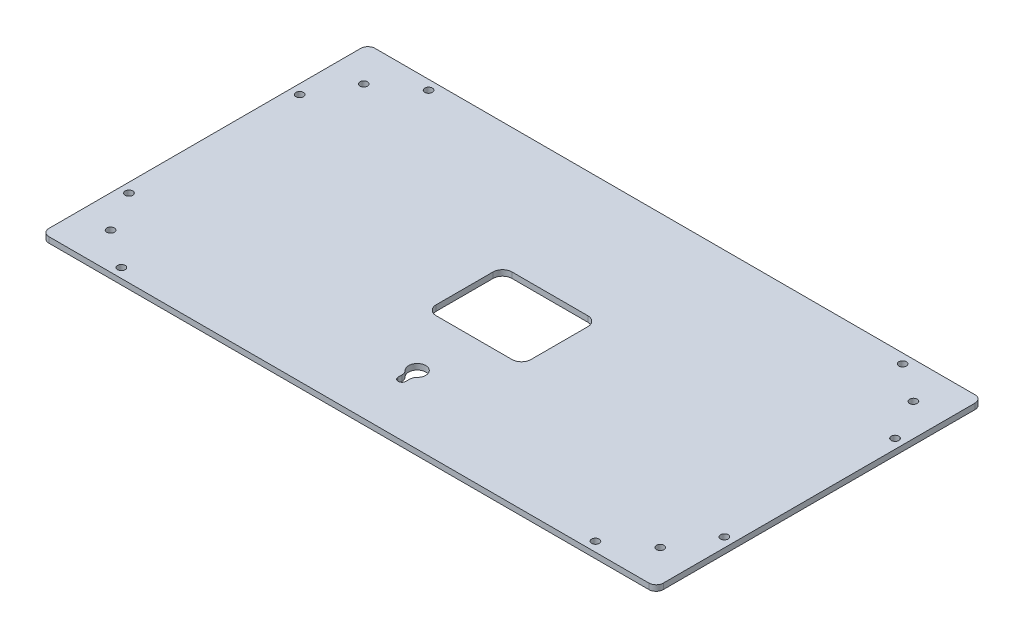
ISO-10303-21;
HEADER;
FILE_DESCRIPTION(('STEP AP214'),'2;1');
FILE_NAME('part.step','',(''),(''),'','','');
FILE_SCHEMA(('AUTOMOTIVE_DESIGN { 1 0 10303 214 1 1 1 1 }'));
ENDSEC;
DATA;
#1=APPLICATION_CONTEXT('core data for automotive mechanical design processes');
#2=APPLICATION_PROTOCOL_DEFINITION('international standard','automotive_design',2000,#1);
#3=PRODUCT_CONTEXT('',#1,'mechanical');
#4=PRODUCT('Part','Part','',(#3));
#5=PRODUCT_RELATED_PRODUCT_CATEGORY('part','',(#4));
#6=PRODUCT_DEFINITION_FORMATION('','',#4);
#7=PRODUCT_DEFINITION_CONTEXT('part definition',#1,'design');
#8=PRODUCT_DEFINITION('design','',#6,#7);
#9=PRODUCT_DEFINITION_SHAPE('','',#8);
#10=(LENGTH_UNIT() NAMED_UNIT(*) SI_UNIT(.MILLI.,.METRE.));
#11=(NAMED_UNIT(*) PLANE_ANGLE_UNIT() SI_UNIT($,.RADIAN.));
#12=(NAMED_UNIT(*) SI_UNIT($,.STERADIAN.) SOLID_ANGLE_UNIT());
#13=UNCERTAINTY_MEASURE_WITH_UNIT(LENGTH_MEASURE(1.E-05),#10,'distance_accuracy_value','');
#14=(GEOMETRIC_REPRESENTATION_CONTEXT(3) GLOBAL_UNCERTAINTY_ASSIGNED_CONTEXT((#13)) GLOBAL_UNIT_ASSIGNED_CONTEXT((#10,
#11,#12)) REPRESENTATION_CONTEXT('',''));
#15=CARTESIAN_POINT('',(0.,0.,0.));
#16=DIRECTION('',(0.,0.,1.));
#17=DIRECTION('',(1.,0.,0.));
#18=AXIS2_PLACEMENT_3D('',#15,#16,#17);
#19=CARTESIAN_POINT('',(158.2,0.,-82.2));
#20=DIRECTION('',(0.,-1.,0.));
#21=DIRECTION('',(0.,0.,-1.));
#22=AXIS2_PLACEMENT_3D('',#19,#20,#21);
#23=CYLINDRICAL_SURFACE('',#22,3.8);
#24=CARTESIAN_POINT('',(158.2,-3.,-82.2));
#25=DIRECTION('',(0.,-1.,0.));
#26=DIRECTION('',(0.,0.,-1.));
#27=AXIS2_PLACEMENT_3D('',#24,#25,#26);
#28=CIRCLE('',#27,3.8);
#29=CARTESIAN_POINT('',(158.2,-3.,-86.));
#30=VERTEX_POINT('',#29);
#31=CARTESIAN_POINT('',(162.,-3.,-82.2));
#32=VERTEX_POINT('',#31);
#33=EDGE_CURVE('E369',#30,#32,#28,.T.);
#34=ORIENTED_EDGE('',*,*,#33,.F.);
#35=DIRECTION('',(0.,-1.,0.));
#36=VECTOR('',#35,1.);
#37=CARTESIAN_POINT('',(158.2,0.,-86.));
#38=LINE('',#37,#36);
#39=CARTESIAN_POINT('',(158.2,0.,-86.));
#40=VERTEX_POINT('',#39);
#41=EDGE_CURVE('E11',#40,#30,#38,.T.);
#42=ORIENTED_EDGE('',*,*,#41,.F.);
#43=CARTESIAN_POINT('',(158.2,0.,-82.2));
#44=DIRECTION('',(0.,-1.,0.));
#45=DIRECTION('',(0.,0.,-1.));
#46=AXIS2_PLACEMENT_3D('',#43,#44,#45);
#47=CIRCLE('',#46,3.8);
#48=CARTESIAN_POINT('',(162.,0.,-82.2));
#49=VERTEX_POINT('',#48);
#50=EDGE_CURVE('E372',#40,#49,#47,.T.);
#51=ORIENTED_EDGE('',*,*,#50,.T.);
#52=DIRECTION('',(0.,-1.,0.));
#53=VECTOR('',#52,1.);
#54=CARTESIAN_POINT('',(162.,0.,-82.2));
#55=LINE('',#54,#53);
#56=EDGE_CURVE('E37',#49,#32,#55,.T.);
#57=ORIENTED_EDGE('',*,*,#56,.T.);
#58=EDGE_LOOP('',(#34,#42,#51,#57));
#59=FACE_BOUND('',#58,.T.);
#60=ADVANCED_FACE('F34',(#59),#23,.T.);
#61=CARTESIAN_POINT('',(-158.2,0.,-86.));
#62=DIRECTION('',(0.,0.,-1.));
#63=DIRECTION('',(-1.,0.,0.));
#64=AXIS2_PLACEMENT_3D('',#61,#62,#63);
#65=PLANE('',#64);
#66=DIRECTION('',(1.,0.,0.));
#67=VECTOR('',#66,1.);
#68=CARTESIAN_POINT('',(-158.2,-3.,-86.));
#69=LINE('',#68,#67);
#70=CARTESIAN_POINT('',(-158.2,-3.,-86.));
#71=VERTEX_POINT('',#70);
#72=EDGE_CURVE('E376',#71,#30,#69,.T.);
#73=ORIENTED_EDGE('',*,*,#72,.F.);
#74=DIRECTION('',(0.,-1.,0.));
#75=VECTOR('',#74,1.);
#76=CARTESIAN_POINT('',(-158.2,0.,-86.));
#77=LINE('',#76,#75);
#78=CARTESIAN_POINT('',(-158.2,0.,-86.));
#79=VERTEX_POINT('',#78);
#80=EDGE_CURVE('E42',#79,#71,#77,.T.);
#81=ORIENTED_EDGE('',*,*,#80,.F.);
#82=DIRECTION('',(1.,0.,0.));
#83=VECTOR('',#82,1.);
#84=CARTESIAN_POINT('',(-158.2,0.,-86.));
#85=LINE('',#84,#83);
#86=EDGE_CURVE('E394',#79,#40,#85,.T.);
#87=ORIENTED_EDGE('',*,*,#86,.T.);
#88=ORIENTED_EDGE('',*,*,#41,.T.);
#89=EDGE_LOOP('',(#73,#81,#87,#88));
#90=FACE_BOUND('',#89,.T.);
#91=ADVANCED_FACE('F441',(#90),#65,.T.);
#92=CARTESIAN_POINT('',(-158.2,0.,-82.2));
#93=DIRECTION('',(0.,-1.,0.));
#94=DIRECTION('',(0.,0.,-1.));
#95=AXIS2_PLACEMENT_3D('',#92,#93,#94);
#96=CYLINDRICAL_SURFACE('',#95,3.8);
#97=CARTESIAN_POINT('',(-158.2,-3.,-82.2));
#98=DIRECTION('',(0.,-1.,0.));
#99=DIRECTION('',(0.,0.,-1.));
#100=AXIS2_PLACEMENT_3D('',#97,#98,#99);
#101=CIRCLE('',#100,3.8);
#102=CARTESIAN_POINT('',(-162.,-3.,-82.2));
#103=VERTEX_POINT('',#102);
#104=EDGE_CURVE('E414',#103,#71,#101,.T.);
#105=ORIENTED_EDGE('',*,*,#104,.F.);
#106=DIRECTION('',(0.,-1.,0.));
#107=VECTOR('',#106,1.);
#108=CARTESIAN_POINT('',(-162.,0.,-82.2));
#109=LINE('',#108,#107);
#110=CARTESIAN_POINT('',(-162.,0.,-82.2));
#111=VERTEX_POINT('',#110);
#112=EDGE_CURVE('E420',#111,#103,#109,.T.);
#113=ORIENTED_EDGE('',*,*,#112,.F.);
#114=CARTESIAN_POINT('',(-158.2,0.,-82.2));
#115=DIRECTION('',(0.,-1.,0.));
#116=DIRECTION('',(0.,0.,-1.));
#117=AXIS2_PLACEMENT_3D('',#114,#115,#116);
#118=CIRCLE('',#117,3.8);
#119=EDGE_CURVE('E391',#111,#79,#118,.T.);
#120=ORIENTED_EDGE('',*,*,#119,.T.);
#121=ORIENTED_EDGE('',*,*,#80,.T.);
#122=EDGE_LOOP('',(#105,#113,#120,#121));
#123=FACE_BOUND('',#122,.T.);
#124=ADVANCED_FACE('F461',(#123),#96,.T.);
#125=CARTESIAN_POINT('',(-162.,0.,82.2));
#126=DIRECTION('',(-1.,0.,0.));
#127=DIRECTION('',(0.,0.,1.));
#128=AXIS2_PLACEMENT_3D('',#125,#126,#127);
#129=PLANE('',#128);
#130=DIRECTION('',(0.,0.,-1.));
#131=VECTOR('',#130,1.);
#132=CARTESIAN_POINT('',(-162.,-3.,82.2));
#133=LINE('',#132,#131);
#134=CARTESIAN_POINT('',(-162.,-3.,82.2));
#135=VERTEX_POINT('',#134);
#136=EDGE_CURVE('E411',#135,#103,#133,.T.);
#137=ORIENTED_EDGE('',*,*,#136,.F.);
#138=DIRECTION('',(0.,-1.,0.));
#139=VECTOR('',#138,1.);
#140=CARTESIAN_POINT('',(-162.,0.,82.2));
#141=LINE('',#140,#139);
#142=CARTESIAN_POINT('',(-162.,0.,82.2));
#143=VERTEX_POINT('',#142);
#144=EDGE_CURVE('E422',#143,#135,#141,.T.);
#145=ORIENTED_EDGE('',*,*,#144,.F.);
#146=DIRECTION('',(0.,0.,-1.));
#147=VECTOR('',#146,1.);
#148=CARTESIAN_POINT('',(-162.,0.,82.2));
#149=LINE('',#148,#147);
#150=EDGE_CURVE('E388',#143,#111,#149,.T.);
#151=ORIENTED_EDGE('',*,*,#150,.T.);
#152=ORIENTED_EDGE('',*,*,#112,.T.);
#153=EDGE_LOOP('',(#137,#145,#151,#152));
#154=FACE_BOUND('',#153,.T.);
#155=ADVANCED_FACE('F459',(#154),#129,.T.);
#156=CARTESIAN_POINT('',(-158.2,0.,82.2));
#157=DIRECTION('',(0.,-1.,0.));
#158=DIRECTION('',(0.,0.,-1.));
#159=AXIS2_PLACEMENT_3D('',#156,#157,#158);
#160=CYLINDRICAL_SURFACE('',#159,3.8);
#161=CARTESIAN_POINT('',(-158.2,-3.,82.2));
#162=DIRECTION('',(0.,-1.,0.));
#163=DIRECTION('',(0.,0.,-1.));
#164=AXIS2_PLACEMENT_3D('',#161,#162,#163);
#165=CIRCLE('',#164,3.8);
#166=CARTESIAN_POINT('',(-158.2,-3.,86.));
#167=VERTEX_POINT('',#166);
#168=EDGE_CURVE('E408',#167,#135,#165,.T.);
#169=ORIENTED_EDGE('',*,*,#168,.F.);
#170=DIRECTION('',(0.,-1.,0.));
#171=VECTOR('',#170,1.);
#172=CARTESIAN_POINT('',(-158.2,0.,86.));
#173=LINE('',#172,#171);
#174=CARTESIAN_POINT('',(-158.2,0.,86.));
#175=VERTEX_POINT('',#174);
#176=EDGE_CURVE('E424',#175,#167,#173,.T.);
#177=ORIENTED_EDGE('',*,*,#176,.F.);
#178=CARTESIAN_POINT('',(-158.2,0.,82.2));
#179=DIRECTION('',(0.,-1.,0.));
#180=DIRECTION('',(0.,0.,-1.));
#181=AXIS2_PLACEMENT_3D('',#178,#179,#180);
#182=CIRCLE('',#181,3.8);
#183=EDGE_CURVE('E385',#175,#143,#182,.T.);
#184=ORIENTED_EDGE('',*,*,#183,.T.);
#185=ORIENTED_EDGE('',*,*,#144,.T.);
#186=EDGE_LOOP('',(#169,#177,#184,#185));
#187=FACE_BOUND('',#186,.T.);
#188=ADVANCED_FACE('F455',(#187),#160,.T.);
#189=CARTESIAN_POINT('',(158.2,0.,86.));
#190=DIRECTION('',(0.,0.,1.));
#191=DIRECTION('',(1.,0.,0.));
#192=AXIS2_PLACEMENT_3D('',#189,#190,#191);
#193=PLANE('',#192);
#194=DIRECTION('',(-1.,0.,0.));
#195=VECTOR('',#194,1.);
#196=CARTESIAN_POINT('',(158.2,-3.,86.));
#197=LINE('',#196,#195);
#198=CARTESIAN_POINT('',(158.2,-3.,86.));
#199=VERTEX_POINT('',#198);
#200=EDGE_CURVE('E405',#199,#167,#197,.T.);
#201=ORIENTED_EDGE('',*,*,#200,.F.);
#202=DIRECTION('',(0.,-1.,0.));
#203=VECTOR('',#202,1.);
#204=CARTESIAN_POINT('',(158.2,0.,86.));
#205=LINE('',#204,#203);
#206=CARTESIAN_POINT('',(158.2,0.,86.));
#207=VERTEX_POINT('',#206);
#208=EDGE_CURVE('E426',#207,#199,#205,.T.);
#209=ORIENTED_EDGE('',*,*,#208,.F.);
#210=DIRECTION('',(-1.,0.,0.));
#211=VECTOR('',#210,1.);
#212=CARTESIAN_POINT('',(158.2,0.,86.));
#213=LINE('',#212,#211);
#214=EDGE_CURVE('E382',#207,#175,#213,.T.);
#215=ORIENTED_EDGE('',*,*,#214,.T.);
#216=ORIENTED_EDGE('',*,*,#176,.T.);
#217=EDGE_LOOP('',(#201,#209,#215,#216));
#218=FACE_BOUND('',#217,.T.);
#219=ADVANCED_FACE('F453',(#218),#193,.T.);
#220=CARTESIAN_POINT('',(158.2,0.,82.2));
#221=DIRECTION('',(0.,-1.,0.));
#222=DIRECTION('',(0.,0.,-1.));
#223=AXIS2_PLACEMENT_3D('',#220,#221,#222);
#224=CYLINDRICAL_SURFACE('',#223,3.8);
#225=CARTESIAN_POINT('',(158.2,-3.,82.2));
#226=DIRECTION('',(0.,-1.,0.));
#227=DIRECTION('',(0.,0.,-1.));
#228=AXIS2_PLACEMENT_3D('',#225,#226,#227);
#229=CIRCLE('',#228,3.8);
#230=CARTESIAN_POINT('',(162.,-3.,82.2));
#231=VERTEX_POINT('',#230);
#232=EDGE_CURVE('E402',#231,#199,#229,.T.);
#233=ORIENTED_EDGE('',*,*,#232,.F.);
#234=DIRECTION('',(0.,-1.,0.));
#235=VECTOR('',#234,1.);
#236=CARTESIAN_POINT('',(162.,0.,82.2));
#237=LINE('',#236,#235);
#238=CARTESIAN_POINT('',(162.,0.,82.2));
#239=VERTEX_POINT('',#238);
#240=EDGE_CURVE('E427',#239,#231,#237,.T.);
#241=ORIENTED_EDGE('',*,*,#240,.F.);
#242=CARTESIAN_POINT('',(158.2,0.,82.2));
#243=DIRECTION('',(0.,-1.,0.));
#244=DIRECTION('',(0.,0.,-1.));
#245=AXIS2_PLACEMENT_3D('',#242,#243,#244);
#246=CIRCLE('',#245,3.8);
#247=EDGE_CURVE('E379',#239,#207,#246,.T.);
#248=ORIENTED_EDGE('',*,*,#247,.T.);
#249=ORIENTED_EDGE('',*,*,#208,.T.);
#250=EDGE_LOOP('',(#233,#241,#248,#249));
#251=FACE_BOUND('',#250,.T.);
#252=ADVANCED_FACE('F449',(#251),#224,.T.);
#253=CARTESIAN_POINT('',(162.,0.,-82.2));
#254=DIRECTION('',(1.,0.,0.));
#255=DIRECTION('',(0.,0.,-1.));
#256=AXIS2_PLACEMENT_3D('',#253,#254,#255);
#257=PLANE('',#256);
#258=DIRECTION('',(0.,0.,1.));
#259=VECTOR('',#258,1.);
#260=CARTESIAN_POINT('',(162.,-3.,-82.2));
#261=LINE('',#260,#259);
#262=EDGE_CURVE('E399',#32,#231,#261,.T.);
#263=ORIENTED_EDGE('',*,*,#262,.F.);
#264=ORIENTED_EDGE('',*,*,#56,.F.);
#265=DIRECTION('',(0.,0.,1.));
#266=VECTOR('',#265,1.);
#267=CARTESIAN_POINT('',(162.,0.,-82.2));
#268=LINE('',#267,#266);
#269=EDGE_CURVE('E375',#49,#239,#268,.T.);
#270=ORIENTED_EDGE('',*,*,#269,.T.);
#271=ORIENTED_EDGE('',*,*,#240,.T.);
#272=EDGE_LOOP('',(#263,#264,#270,#271));
#273=FACE_BOUND('',#272,.T.);
#274=ADVANCED_FACE('F435',(#273),#257,.T.);
#275=CARTESIAN_POINT('',(158.2,0.,-82.2));
#276=DIRECTION('',(0.,-1.,0.));
#277=DIRECTION('',(0.,0.,-1.));
#278=AXIS2_PLACEMENT_3D('',#275,#276,#277);
#279=PLANE('',#278);
#280=DIRECTION('',(0.,0.,1.));
#281=VECTOR('',#280,1.);
#282=CARTESIAN_POINT('',(25.,0.,15.));
#283=LINE('',#282,#281);
#284=CARTESIAN_POINT('',(25.,0.,-15.));
#285=VERTEX_POINT('',#284);
#286=CARTESIAN_POINT('',(25.,0.,15.));
#287=VERTEX_POINT('',#286);
#288=EDGE_CURVE('E191',#285,#287,#283,.T.);
#289=ORIENTED_EDGE('',*,*,#288,.T.);
#290=CARTESIAN_POINT('',(20.,0.,15.));
#291=DIRECTION('',(0.,-1.,0.));
#292=DIRECTION('',(0.,0.,1.));
#293=AXIS2_PLACEMENT_3D('',#290,#291,#292);
#294=CIRCLE('',#293,5.);
#295=CARTESIAN_POINT('',(20.,0.,20.));
#296=VERTEX_POINT('',#295);
#297=EDGE_CURVE('E185',#287,#296,#294,.T.);
#298=ORIENTED_EDGE('',*,*,#297,.T.);
#299=DIRECTION('',(-1.,0.,0.));
#300=VECTOR('',#299,1.);
#301=CARTESIAN_POINT('',(-20.,0.,20.));
#302=LINE('',#301,#300);
#303=CARTESIAN_POINT('',(-20.,0.,20.));
#304=VERTEX_POINT('',#303);
#305=EDGE_CURVE('E194',#296,#304,#302,.T.);
#306=ORIENTED_EDGE('',*,*,#305,.T.);
#307=CARTESIAN_POINT('',(-20.,0.,15.));
#308=DIRECTION('',(0.,-1.,0.));
#309=DIRECTION('',(0.,0.,1.));
#310=AXIS2_PLACEMENT_3D('',#307,#308,#309);
#311=CIRCLE('',#310,5.);
#312=CARTESIAN_POINT('',(-25.,0.,15.));
#313=VERTEX_POINT('',#312);
#314=EDGE_CURVE('E50',#304,#313,#311,.T.);
#315=ORIENTED_EDGE('',*,*,#314,.T.);
#316=DIRECTION('',(0.,0.,-1.));
#317=VECTOR('',#316,1.);
#318=CARTESIAN_POINT('',(-25.,0.,-15.));
#319=LINE('',#318,#317);
#320=CARTESIAN_POINT('',(-25.,0.,-15.));
#321=VERTEX_POINT('',#320);
#322=EDGE_CURVE('E209',#313,#321,#319,.T.);
#323=ORIENTED_EDGE('',*,*,#322,.T.);
#324=CARTESIAN_POINT('',(-20.,0.,-15.));
#325=DIRECTION('',(0.,-1.,0.));
#326=DIRECTION('',(0.,0.,1.));
#327=AXIS2_PLACEMENT_3D('',#324,#325,#326);
#328=CIRCLE('',#327,5.);
#329=CARTESIAN_POINT('',(-20.,0.,-20.));
#330=VERTEX_POINT('',#329);
#331=EDGE_CURVE('E212',#321,#330,#328,.T.);
#332=ORIENTED_EDGE('',*,*,#331,.T.);
#333=DIRECTION('',(1.,0.,0.));
#334=VECTOR('',#333,1.);
#335=CARTESIAN_POINT('',(20.,0.,-20.));
#336=LINE('',#335,#334);
#337=CARTESIAN_POINT('',(20.,0.,-20.));
#338=VERTEX_POINT('',#337);
#339=EDGE_CURVE('E215',#330,#338,#336,.T.);
#340=ORIENTED_EDGE('',*,*,#339,.T.);
#341=CARTESIAN_POINT('',(20.,0.,-15.));
#342=DIRECTION('',(0.,-1.,0.));
#343=DIRECTION('',(0.,0.,1.));
#344=AXIS2_PLACEMENT_3D('',#341,#342,#343);
#345=CIRCLE('',#344,5.);
#346=EDGE_CURVE('E218',#338,#285,#345,.T.);
#347=ORIENTED_EDGE('',*,*,#346,.T.);
#348=EDGE_LOOP('',(#289,#298,#306,#315,#323,#332,#340,#347));
#349=FACE_BOUND('',#348,.T.);
#350=CARTESIAN_POINT('',(-125.,0.,81.));
#351=DIRECTION('',(0.,-1.,0.));
#352=DIRECTION('',(0.,0.,1.));
#353=AXIS2_PLACEMENT_3D('',#350,#351,#352);
#354=CIRCLE('',#353,2.);
#355=CARTESIAN_POINT('',(-125.,0.,83.));
#356=VERTEX_POINT('',#355);
#357=EDGE_CURVE('E252',#356,#356,#354,.T.);
#358=ORIENTED_EDGE('',*,*,#357,.T.);
#359=EDGE_LOOP('',(#358));
#360=FACE_BOUND('',#359,.T.);
#361=CARTESIAN_POINT('',(125.,0.,81.));
#362=DIRECTION('',(0.,-1.,0.));
#363=DIRECTION('',(0.,0.,1.));
#364=AXIS2_PLACEMENT_3D('',#361,#362,#363);
#365=CIRCLE('',#364,2.);
#366=CARTESIAN_POINT('',(125.,0.,83.));
#367=VERTEX_POINT('',#366);
#368=EDGE_CURVE('E258',#367,#367,#365,.T.);
#369=ORIENTED_EDGE('',*,*,#368,.T.);
#370=EDGE_LOOP('',(#369));
#371=FACE_BOUND('',#370,.T.);
#372=CARTESIAN_POINT('',(-157.,0.,45.));
#373=DIRECTION('',(0.,-1.,0.));
#374=DIRECTION('',(0.,0.,1.));
#375=AXIS2_PLACEMENT_3D('',#372,#373,#374);
#376=CIRCLE('',#375,2.);
#377=CARTESIAN_POINT('',(-157.,0.,47.));
#378=VERTEX_POINT('',#377);
#379=EDGE_CURVE('E264',#378,#378,#376,.T.);
#380=ORIENTED_EDGE('',*,*,#379,.T.);
#381=EDGE_LOOP('',(#380));
#382=FACE_BOUND('',#381,.T.);
#383=CARTESIAN_POINT('',(-157.,0.,-45.));
#384=DIRECTION('',(0.,-1.,0.));
#385=DIRECTION('',(0.,0.,1.));
#386=AXIS2_PLACEMENT_3D('',#383,#384,#385);
#387=CIRCLE('',#386,2.);
#388=CARTESIAN_POINT('',(-157.,0.,-43.));
#389=VERTEX_POINT('',#388);
#390=EDGE_CURVE('E270',#389,#389,#387,.T.);
#391=ORIENTED_EDGE('',*,*,#390,.T.);
#392=EDGE_LOOP('',(#391));
#393=FACE_BOUND('',#392,.T.);
#394=CARTESIAN_POINT('',(-125.,0.,-81.));
#395=DIRECTION('',(0.,-1.,0.));
#396=DIRECTION('',(0.,0.,1.));
#397=AXIS2_PLACEMENT_3D('',#394,#395,#396);
#398=CIRCLE('',#397,2.);
#399=CARTESIAN_POINT('',(-125.,0.,-79.));
#400=VERTEX_POINT('',#399);
#401=EDGE_CURVE('E276',#400,#400,#398,.T.);
#402=ORIENTED_EDGE('',*,*,#401,.T.);
#403=EDGE_LOOP('',(#402));
#404=FACE_BOUND('',#403,.T.);
#405=CARTESIAN_POINT('',(125.,0.,-81.));
#406=DIRECTION('',(0.,-1.,0.));
#407=DIRECTION('',(0.,0.,1.));
#408=AXIS2_PLACEMENT_3D('',#405,#406,#407);
#409=CIRCLE('',#408,2.);
#410=CARTESIAN_POINT('',(125.,0.,-79.));
#411=VERTEX_POINT('',#410);
#412=EDGE_CURVE('E282',#411,#411,#409,.T.);
#413=ORIENTED_EDGE('',*,*,#412,.T.);
#414=EDGE_LOOP('',(#413));
#415=FACE_BOUND('',#414,.T.);
#416=CARTESIAN_POINT('',(157.,0.,-45.));
#417=DIRECTION('',(0.,-1.,0.));
#418=DIRECTION('',(0.,0.,1.));
#419=AXIS2_PLACEMENT_3D('',#416,#417,#418);
#420=CIRCLE('',#419,2.);
#421=CARTESIAN_POINT('',(157.,0.,-43.));
#422=VERTEX_POINT('',#421);
#423=EDGE_CURVE('E288',#422,#422,#420,.T.);
#424=ORIENTED_EDGE('',*,*,#423,.T.);
#425=EDGE_LOOP('',(#424));
#426=FACE_BOUND('',#425,.T.);
#427=CARTESIAN_POINT('',(157.,0.,45.));
#428=DIRECTION('',(0.,-1.,0.));
#429=DIRECTION('',(0.,0.,1.));
#430=AXIS2_PLACEMENT_3D('',#427,#428,#429);
#431=CIRCLE('',#430,2.);
#432=CARTESIAN_POINT('',(157.,0.,47.));
#433=VERTEX_POINT('',#432);
#434=EDGE_CURVE('E294',#433,#433,#431,.T.);
#435=ORIENTED_EDGE('',*,*,#434,.T.);
#436=EDGE_LOOP('',(#435));
#437=FACE_BOUND('',#436,.T.);
#438=DIRECTION('',(0.,0.,1.));
#439=VECTOR('',#438,1.);
#440=CARTESIAN_POINT('',(2.,0.,58.));
#441=LINE('',#440,#439);
#442=CARTESIAN_POINT('',(1.99999999999998,0.,56.));
#443=VERTEX_POINT('',#442);
#444=CARTESIAN_POINT('',(2.,0.,58.));
#445=VERTEX_POINT('',#444);
#446=EDGE_CURVE('E316',#443,#445,#441,.T.);
#447=ORIENTED_EDGE('',*,*,#446,.T.);
#448=CARTESIAN_POINT('',(0.,0.,58.));
#449=DIRECTION('',(0.,-1.,0.));
#450=DIRECTION('',(0.,0.,1.));
#451=AXIS2_PLACEMENT_3D('',#448,#449,#450);
#452=CIRCLE('',#451,2.);
#453=CARTESIAN_POINT('',(-2.,0.,58.));
#454=VERTEX_POINT('',#453);
#455=EDGE_CURVE('E300',#445,#454,#452,.T.);
#456=ORIENTED_EDGE('',*,*,#455,.T.);
#457=DIRECTION('',(0.,0.,-1.));
#458=VECTOR('',#457,1.);
#459=CARTESIAN_POINT('',(-2.,0.,56.));
#460=LINE('',#459,#458);
#461=CARTESIAN_POINT('',(-2.,0.,56.));
#462=VERTEX_POINT('',#461);
#463=EDGE_CURVE('E303',#454,#462,#460,.T.);
#464=ORIENTED_EDGE('',*,*,#463,.T.);
#465=CARTESIAN_POINT('',(-6.,0.,56.));
#466=DIRECTION('',(0.,1.,0.));
#467=DIRECTION('',(0.,0.,-1.));
#468=AXIS2_PLACEMENT_3D('',#465,#466,#467);
#469=CIRCLE('',#468,4.00000000000002);
#470=CARTESIAN_POINT('',(-3.17647058823531,0.,53.1666836285194));
#471=VERTEX_POINT('',#470);
#472=EDGE_CURVE('E307',#462,#471,#469,.T.);
#473=ORIENTED_EDGE('',*,*,#472,.T.);
#474=CARTESIAN_POINT('',(0.,0.,49.9792027106038));
#475=DIRECTION('',(0.,-1.,0.));
#476=DIRECTION('',(0.,0.,1.));
#477=AXIS2_PLACEMENT_3D('',#474,#475,#476);
#478=CIRCLE('',#477,4.5);
#479=CARTESIAN_POINT('',(3.1764705882353,0.,53.1666836285194));
#480=VERTEX_POINT('',#479);
#481=EDGE_CURVE('E310',#471,#480,#478,.T.);
#482=ORIENTED_EDGE('',*,*,#481,.T.);
#483=CARTESIAN_POINT('',(6.,0.,56.));
#484=DIRECTION('',(0.,1.,0.));
#485=DIRECTION('',(0.,0.,-1.));
#486=AXIS2_PLACEMENT_3D('',#483,#484,#485);
#487=CIRCLE('',#486,4.00000000000002);
#488=EDGE_CURVE('E313',#480,#443,#487,.T.);
#489=ORIENTED_EDGE('',*,*,#488,.T.);
#490=EDGE_LOOP('',(#447,#456,#464,#473,#482,#489));
#491=FACE_BOUND('',#490,.T.);
#492=CARTESIAN_POINT('',(144.95,0.,66.75));
#493=DIRECTION('',(0.,-1.,0.));
#494=DIRECTION('',(0.,0.,1.));
#495=AXIS2_PLACEMENT_3D('',#492,#493,#494);
#496=CIRCLE('',#495,2.);
#497=CARTESIAN_POINT('',(144.95,0.,68.75));
#498=VERTEX_POINT('',#497);
#499=EDGE_CURVE('E348',#498,#498,#496,.T.);
#500=ORIENTED_EDGE('',*,*,#499,.T.);
#501=EDGE_LOOP('',(#500));
#502=FACE_BOUND('',#501,.T.);
#503=CARTESIAN_POINT('',(144.95,0.,-66.75));
#504=DIRECTION('',(0.,-1.,0.));
#505=DIRECTION('',(0.,0.,1.));
#506=AXIS2_PLACEMENT_3D('',#503,#504,#505);
#507=CIRCLE('',#506,2.);
#508=CARTESIAN_POINT('',(144.95,0.,-64.75));
#509=VERTEX_POINT('',#508);
#510=EDGE_CURVE('E354',#509,#509,#507,.T.);
#511=ORIENTED_EDGE('',*,*,#510,.T.);
#512=EDGE_LOOP('',(#511));
#513=FACE_BOUND('',#512,.T.);
#514=CARTESIAN_POINT('',(-144.95,0.,-66.75));
#515=DIRECTION('',(0.,-1.,0.));
#516=DIRECTION('',(0.,0.,1.));
#517=AXIS2_PLACEMENT_3D('',#514,#515,#516);
#518=CIRCLE('',#517,2.);
#519=CARTESIAN_POINT('',(-144.95,0.,-64.75));
#520=VERTEX_POINT('',#519);
#521=EDGE_CURVE('E360',#520,#520,#518,.T.);
#522=ORIENTED_EDGE('',*,*,#521,.T.);
#523=EDGE_LOOP('',(#522));
#524=FACE_BOUND('',#523,.T.);
#525=CARTESIAN_POINT('',(-144.95,0.,66.75));
#526=DIRECTION('',(0.,-1.,0.));
#527=DIRECTION('',(0.,0.,1.));
#528=AXIS2_PLACEMENT_3D('',#525,#526,#527);
#529=CIRCLE('',#528,2.);
#530=CARTESIAN_POINT('',(-144.95,0.,68.75));
#531=VERTEX_POINT('',#530);
#532=EDGE_CURVE('E366',#531,#531,#529,.T.);
#533=ORIENTED_EDGE('',*,*,#532,.T.);
#534=EDGE_LOOP('',(#533));
#535=FACE_BOUND('',#534,.T.);
#536=ORIENTED_EDGE('',*,*,#50,.F.);
#537=ORIENTED_EDGE('',*,*,#86,.F.);
#538=ORIENTED_EDGE('',*,*,#119,.F.);
#539=ORIENTED_EDGE('',*,*,#150,.F.);
#540=ORIENTED_EDGE('',*,*,#183,.F.);
#541=ORIENTED_EDGE('',*,*,#214,.F.);
#542=ORIENTED_EDGE('',*,*,#247,.F.);
#543=ORIENTED_EDGE('',*,*,#269,.F.);
#544=EDGE_LOOP('',(#536,#537,#538,#539,#540,#541,#542,#543));
#545=FACE_BOUND('',#544,.T.);
#546=ADVANCED_FACE('F198',(#349,#360,#371,#382,#393,#404,#415,#426,#437,#491,#502,#513,#524,
#535,#545),#279,.F.);
#547=CARTESIAN_POINT('',(158.2,-3.,-82.2));
#548=DIRECTION('',(0.,-1.,0.));
#549=DIRECTION('',(0.,0.,-1.));
#550=AXIS2_PLACEMENT_3D('',#547,#548,#549);
#551=PLANE('',#550);
#552=CARTESIAN_POINT('',(20.,-3.,15.));
#553=DIRECTION('',(0.,-1.,0.));
#554=DIRECTION('',(0.,0.,1.));
#555=AXIS2_PLACEMENT_3D('',#552,#553,#554);
#556=CIRCLE('',#555,5.);
#557=CARTESIAN_POINT('',(25.,-3.,15.));
#558=VERTEX_POINT('',#557);
#559=CARTESIAN_POINT('',(20.,-3.,20.));
#560=VERTEX_POINT('',#559);
#561=EDGE_CURVE('E58',#558,#560,#556,.T.);
#562=ORIENTED_EDGE('',*,*,#561,.F.);
#563=DIRECTION('',(0.,0.,1.));
#564=VECTOR('',#563,1.);
#565=CARTESIAN_POINT('',(25.,-3.,15.));
#566=LINE('',#565,#564);
#567=CARTESIAN_POINT('',(25.,-3.,-15.));
#568=VERTEX_POINT('',#567);
#569=EDGE_CURVE('E202',#568,#558,#566,.T.);
#570=ORIENTED_EDGE('',*,*,#569,.F.);
#571=CARTESIAN_POINT('',(20.,-3.,-15.));
#572=DIRECTION('',(0.,-1.,0.));
#573=DIRECTION('',(0.,0.,1.));
#574=AXIS2_PLACEMENT_3D('',#571,#572,#573);
#575=CIRCLE('',#574,5.);
#576=CARTESIAN_POINT('',(20.,-3.,-20.));
#577=VERTEX_POINT('',#576);
#578=EDGE_CURVE('E205',#577,#568,#575,.T.);
#579=ORIENTED_EDGE('',*,*,#578,.F.);
#580=DIRECTION('',(1.,0.,0.));
#581=VECTOR('',#580,1.);
#582=CARTESIAN_POINT('',(20.,-3.,-20.));
#583=LINE('',#582,#581);
#584=CARTESIAN_POINT('',(-20.,-3.,-20.));
#585=VERTEX_POINT('',#584);
#586=EDGE_CURVE('E233',#585,#577,#583,.T.);
#587=ORIENTED_EDGE('',*,*,#586,.F.);
#588=CARTESIAN_POINT('',(-20.,-3.,-15.));
#589=DIRECTION('',(0.,-1.,0.));
#590=DIRECTION('',(0.,0.,1.));
#591=AXIS2_PLACEMENT_3D('',#588,#589,#590);
#592=CIRCLE('',#591,5.);
#593=CARTESIAN_POINT('',(-25.,-3.,-15.));
#594=VERTEX_POINT('',#593);
#595=EDGE_CURVE('E230',#594,#585,#592,.T.);
#596=ORIENTED_EDGE('',*,*,#595,.F.);
#597=DIRECTION('',(0.,0.,-1.));
#598=VECTOR('',#597,1.);
#599=CARTESIAN_POINT('',(-25.,-3.,-15.));
#600=LINE('',#599,#598);
#601=CARTESIAN_POINT('',(-25.,-3.,15.));
#602=VERTEX_POINT('',#601);
#603=EDGE_CURVE('E227',#602,#594,#600,.T.);
#604=ORIENTED_EDGE('',*,*,#603,.F.);
#605=CARTESIAN_POINT('',(-20.,-3.,15.));
#606=DIRECTION('',(0.,-1.,0.));
#607=DIRECTION('',(0.,0.,1.));
#608=AXIS2_PLACEMENT_3D('',#605,#606,#607);
#609=CIRCLE('',#608,5.);
#610=CARTESIAN_POINT('',(-20.,-3.,20.));
#611=VERTEX_POINT('',#610);
#612=EDGE_CURVE('E224',#611,#602,#609,.T.);
#613=ORIENTED_EDGE('',*,*,#612,.F.);
#614=DIRECTION('',(-1.,0.,0.));
#615=VECTOR('',#614,1.);
#616=CARTESIAN_POINT('',(-20.,-3.,20.));
#617=LINE('',#616,#615);
#618=EDGE_CURVE('E222',#560,#611,#617,.T.);
#619=ORIENTED_EDGE('',*,*,#618,.F.);
#620=EDGE_LOOP('',(#562,#570,#579,#587,#596,#604,#613,#619));
#621=FACE_BOUND('',#620,.T.);
#622=CARTESIAN_POINT('',(-125.,-3.,81.));
#623=DIRECTION('',(0.,-1.,0.));
#624=DIRECTION('',(0.,0.,1.));
#625=AXIS2_PLACEMENT_3D('',#622,#623,#624);
#626=CIRCLE('',#625,2.);
#627=CARTESIAN_POINT('',(-125.,-3.,83.));
#628=VERTEX_POINT('',#627);
#629=EDGE_CURVE('E240',#628,#628,#626,.T.);
#630=ORIENTED_EDGE('',*,*,#629,.F.);
#631=EDGE_LOOP('',(#630));
#632=FACE_BOUND('',#631,.T.);
#633=CARTESIAN_POINT('',(125.,-3.,81.));
#634=DIRECTION('',(0.,-1.,0.));
#635=DIRECTION('',(0.,0.,1.));
#636=AXIS2_PLACEMENT_3D('',#633,#634,#635);
#637=CIRCLE('',#636,2.);
#638=CARTESIAN_POINT('',(125.,-3.,83.));
#639=VERTEX_POINT('',#638);
#640=EDGE_CURVE('E255',#639,#639,#637,.T.);
#641=ORIENTED_EDGE('',*,*,#640,.F.);
#642=EDGE_LOOP('',(#641));
#643=FACE_BOUND('',#642,.T.);
#644=CARTESIAN_POINT('',(-157.,-3.,45.));
#645=DIRECTION('',(0.,-1.,0.));
#646=DIRECTION('',(0.,0.,1.));
#647=AXIS2_PLACEMENT_3D('',#644,#645,#646);
#648=CIRCLE('',#647,2.);
#649=CARTESIAN_POINT('',(-157.,-3.,47.));
#650=VERTEX_POINT('',#649);
#651=EDGE_CURVE('E261',#650,#650,#648,.T.);
#652=ORIENTED_EDGE('',*,*,#651,.F.);
#653=EDGE_LOOP('',(#652));
#654=FACE_BOUND('',#653,.T.);
#655=CARTESIAN_POINT('',(-157.,-3.,-45.));
#656=DIRECTION('',(0.,-1.,0.));
#657=DIRECTION('',(0.,0.,1.));
#658=AXIS2_PLACEMENT_3D('',#655,#656,#657);
#659=CIRCLE('',#658,2.);
#660=CARTESIAN_POINT('',(-157.,-3.,-43.));
#661=VERTEX_POINT('',#660);
#662=EDGE_CURVE('E267',#661,#661,#659,.T.);
#663=ORIENTED_EDGE('',*,*,#662,.F.);
#664=EDGE_LOOP('',(#663));
#665=FACE_BOUND('',#664,.T.);
#666=CARTESIAN_POINT('',(-125.,-3.,-81.));
#667=DIRECTION('',(0.,-1.,0.));
#668=DIRECTION('',(0.,0.,1.));
#669=AXIS2_PLACEMENT_3D('',#666,#667,#668);
#670=CIRCLE('',#669,2.);
#671=CARTESIAN_POINT('',(-125.,-3.,-79.));
#672=VERTEX_POINT('',#671);
#673=EDGE_CURVE('E273',#672,#672,#670,.T.);
#674=ORIENTED_EDGE('',*,*,#673,.F.);
#675=EDGE_LOOP('',(#674));
#676=FACE_BOUND('',#675,.T.);
#677=CARTESIAN_POINT('',(125.,-3.,-81.));
#678=DIRECTION('',(0.,-1.,0.));
#679=DIRECTION('',(0.,0.,1.));
#680=AXIS2_PLACEMENT_3D('',#677,#678,#679);
#681=CIRCLE('',#680,2.);
#682=CARTESIAN_POINT('',(125.,-3.,-79.));
#683=VERTEX_POINT('',#682);
#684=EDGE_CURVE('E279',#683,#683,#681,.T.);
#685=ORIENTED_EDGE('',*,*,#684,.F.);
#686=EDGE_LOOP('',(#685));
#687=FACE_BOUND('',#686,.T.);
#688=CARTESIAN_POINT('',(157.,-3.,-45.));
#689=DIRECTION('',(0.,-1.,0.));
#690=DIRECTION('',(0.,0.,1.));
#691=AXIS2_PLACEMENT_3D('',#688,#689,#690);
#692=CIRCLE('',#691,2.);
#693=CARTESIAN_POINT('',(157.,-3.,-43.));
#694=VERTEX_POINT('',#693);
#695=EDGE_CURVE('E285',#694,#694,#692,.T.);
#696=ORIENTED_EDGE('',*,*,#695,.F.);
#697=EDGE_LOOP('',(#696));
#698=FACE_BOUND('',#697,.T.);
#699=CARTESIAN_POINT('',(157.,-3.,45.));
#700=DIRECTION('',(0.,-1.,0.));
#701=DIRECTION('',(0.,0.,1.));
#702=AXIS2_PLACEMENT_3D('',#699,#700,#701);
#703=CIRCLE('',#702,2.);
#704=CARTESIAN_POINT('',(157.,-3.,47.));
#705=VERTEX_POINT('',#704);
#706=EDGE_CURVE('E291',#705,#705,#703,.T.);
#707=ORIENTED_EDGE('',*,*,#706,.F.);
#708=EDGE_LOOP('',(#707));
#709=FACE_BOUND('',#708,.T.);
#710=CARTESIAN_POINT('',(0.,-3.,58.));
#711=DIRECTION('',(0.,-1.,0.));
#712=DIRECTION('',(0.,0.,1.));
#713=AXIS2_PLACEMENT_3D('',#710,#711,#712);
#714=CIRCLE('',#713,2.);
#715=CARTESIAN_POINT('',(2.,-3.,58.));
#716=VERTEX_POINT('',#715);
#717=CARTESIAN_POINT('',(-2.,-3.,58.));
#718=VERTEX_POINT('',#717);
#719=EDGE_CURVE('E297',#716,#718,#714,.T.);
#720=ORIENTED_EDGE('',*,*,#719,.F.);
#721=DIRECTION('',(0.,0.,1.));
#722=VECTOR('',#721,1.);
#723=CARTESIAN_POINT('',(2.,-3.,58.));
#724=LINE('',#723,#722);
#725=CARTESIAN_POINT('',(1.99999999999998,-3.,56.));
#726=VERTEX_POINT('',#725);
#727=EDGE_CURVE('E304',#726,#716,#724,.T.);
#728=ORIENTED_EDGE('',*,*,#727,.F.);
#729=CARTESIAN_POINT('',(6.,-3.,56.));
#730=DIRECTION('',(0.,1.,0.));
#731=DIRECTION('',(0.,0.,-1.));
#732=AXIS2_PLACEMENT_3D('',#729,#730,#731);
#733=CIRCLE('',#732,4.00000000000002);
#734=CARTESIAN_POINT('',(3.1764705882353,-3.,53.1666836285194));
#735=VERTEX_POINT('',#734);
#736=EDGE_CURVE('E330',#735,#726,#733,.T.);
#737=ORIENTED_EDGE('',*,*,#736,.F.);
#738=CARTESIAN_POINT('',(0.,-3.,49.9792027106038));
#739=DIRECTION('',(0.,-1.,0.));
#740=DIRECTION('',(0.,0.,1.));
#741=AXIS2_PLACEMENT_3D('',#738,#739,#740);
#742=CIRCLE('',#741,4.5);
#743=CARTESIAN_POINT('',(-3.17647058823531,-3.,53.1666836285194));
#744=VERTEX_POINT('',#743);
#745=EDGE_CURVE('E327',#744,#735,#742,.T.);
#746=ORIENTED_EDGE('',*,*,#745,.F.);
#747=CARTESIAN_POINT('',(-6.,-3.,56.));
#748=DIRECTION('',(0.,1.,0.));
#749=DIRECTION('',(0.,0.,-1.));
#750=AXIS2_PLACEMENT_3D('',#747,#748,#749);
#751=CIRCLE('',#750,4.00000000000002);
#752=CARTESIAN_POINT('',(-2.,-3.,56.));
#753=VERTEX_POINT('',#752);
#754=EDGE_CURVE('E324',#753,#744,#751,.T.);
#755=ORIENTED_EDGE('',*,*,#754,.F.);
#756=DIRECTION('',(0.,0.,-1.));
#757=VECTOR('',#756,1.);
#758=CARTESIAN_POINT('',(-2.,-3.,56.));
#759=LINE('',#758,#757);
#760=EDGE_CURVE('E321',#718,#753,#759,.T.);
#761=ORIENTED_EDGE('',*,*,#760,.F.);
#762=EDGE_LOOP('',(#720,#728,#737,#746,#755,#761));
#763=FACE_BOUND('',#762,.T.);
#764=CARTESIAN_POINT('',(144.95,-3.,66.75));
#765=DIRECTION('',(0.,-1.,0.));
#766=DIRECTION('',(0.,0.,1.));
#767=AXIS2_PLACEMENT_3D('',#764,#765,#766);
#768=CIRCLE('',#767,2.);
#769=CARTESIAN_POINT('',(144.95,-3.,68.75));
#770=VERTEX_POINT('',#769);
#771=EDGE_CURVE('E337',#770,#770,#768,.T.);
#772=ORIENTED_EDGE('',*,*,#771,.F.);
#773=EDGE_LOOP('',(#772));
#774=FACE_BOUND('',#773,.T.);
#775=CARTESIAN_POINT('',(144.95,-3.,-66.75));
#776=DIRECTION('',(0.,-1.,0.));
#777=DIRECTION('',(0.,0.,1.));
#778=AXIS2_PLACEMENT_3D('',#775,#776,#777);
#779=CIRCLE('',#778,2.);
#780=CARTESIAN_POINT('',(144.95,-3.,-64.75));
#781=VERTEX_POINT('',#780);
#782=EDGE_CURVE('E351',#781,#781,#779,.T.);
#783=ORIENTED_EDGE('',*,*,#782,.F.);
#784=EDGE_LOOP('',(#783));
#785=FACE_BOUND('',#784,.T.);
#786=CARTESIAN_POINT('',(-144.95,-3.,-66.75));
#787=DIRECTION('',(0.,-1.,0.));
#788=DIRECTION('',(0.,0.,1.));
#789=AXIS2_PLACEMENT_3D('',#786,#787,#788);
#790=CIRCLE('',#789,2.);
#791=CARTESIAN_POINT('',(-144.95,-3.,-64.75));
#792=VERTEX_POINT('',#791);
#793=EDGE_CURVE('E357',#792,#792,#790,.T.);
#794=ORIENTED_EDGE('',*,*,#793,.F.);
#795=EDGE_LOOP('',(#794));
#796=FACE_BOUND('',#795,.T.);
#797=CARTESIAN_POINT('',(-144.95,-3.,66.75));
#798=DIRECTION('',(0.,-1.,0.));
#799=DIRECTION('',(0.,0.,1.));
#800=AXIS2_PLACEMENT_3D('',#797,#798,#799);
#801=CIRCLE('',#800,2.);
#802=CARTESIAN_POINT('',(-144.95,-3.,68.75));
#803=VERTEX_POINT('',#802);
#804=EDGE_CURVE('E363',#803,#803,#801,.T.);
#805=ORIENTED_EDGE('',*,*,#804,.F.);
#806=EDGE_LOOP('',(#805));
#807=FACE_BOUND('',#806,.T.);
#808=ORIENTED_EDGE('',*,*,#33,.T.);
#809=ORIENTED_EDGE('',*,*,#262,.T.);
#810=ORIENTED_EDGE('',*,*,#232,.T.);
#811=ORIENTED_EDGE('',*,*,#200,.T.);
#812=ORIENTED_EDGE('',*,*,#168,.T.);
#813=ORIENTED_EDGE('',*,*,#136,.T.);
#814=ORIENTED_EDGE('',*,*,#104,.T.);
#815=ORIENTED_EDGE('',*,*,#72,.T.);
#816=EDGE_LOOP('',(#808,#809,#810,#811,#812,#813,#814,#815));
#817=FACE_BOUND('',#816,.T.);
#818=ADVANCED_FACE('F437',(#621,#632,#643,#654,#665,#676,#687,#698,#709,#763,#774,#785,#796,
#807,#817),#551,.T.);
#819=CARTESIAN_POINT('',(-144.95,0.,66.75));
#820=DIRECTION('',(0.,-1.,0.));
#821=DIRECTION('',(0.,0.,-1.));
#822=AXIS2_PLACEMENT_3D('',#819,#820,#821);
#823=CYLINDRICAL_SURFACE('',#822,2.);
#824=ORIENTED_EDGE('',*,*,#532,.F.);
#825=EDGE_LOOP('',(#824));
#826=FACE_BOUND('',#825,.T.);
#827=ORIENTED_EDGE('',*,*,#804,.T.);
#828=EDGE_LOOP('',(#827));
#829=FACE_BOUND('',#828,.T.);
#830=ADVANCED_FACE('F535',(#826,#829),#823,.F.);
#831=CARTESIAN_POINT('',(-144.95,0.,-66.75));
#832=DIRECTION('',(0.,-1.,0.));
#833=DIRECTION('',(0.,0.,-1.));
#834=AXIS2_PLACEMENT_3D('',#831,#832,#833);
#835=CYLINDRICAL_SURFACE('',#834,2.);
#836=ORIENTED_EDGE('',*,*,#521,.F.);
#837=EDGE_LOOP('',(#836));
#838=FACE_BOUND('',#837,.T.);
#839=ORIENTED_EDGE('',*,*,#793,.T.);
#840=EDGE_LOOP('',(#839));
#841=FACE_BOUND('',#840,.T.);
#842=ADVANCED_FACE('F545',(#838,#841),#835,.F.);
#843=CARTESIAN_POINT('',(144.95,0.,-66.75));
#844=DIRECTION('',(0.,-1.,0.));
#845=DIRECTION('',(0.,0.,-1.));
#846=AXIS2_PLACEMENT_3D('',#843,#844,#845);
#847=CYLINDRICAL_SURFACE('',#846,2.);
#848=ORIENTED_EDGE('',*,*,#510,.F.);
#849=EDGE_LOOP('',(#848));
#850=FACE_BOUND('',#849,.T.);
#851=ORIENTED_EDGE('',*,*,#782,.T.);
#852=EDGE_LOOP('',(#851));
#853=FACE_BOUND('',#852,.T.);
#854=ADVANCED_FACE('F555',(#850,#853),#847,.F.);
#855=CARTESIAN_POINT('',(144.95,0.,66.75));
#856=DIRECTION('',(0.,-1.,0.));
#857=DIRECTION('',(0.,0.,-1.));
#858=AXIS2_PLACEMENT_3D('',#855,#856,#857);
#859=CYLINDRICAL_SURFACE('',#858,2.);
#860=ORIENTED_EDGE('',*,*,#499,.F.);
#861=EDGE_LOOP('',(#860));
#862=FACE_BOUND('',#861,.T.);
#863=ORIENTED_EDGE('',*,*,#771,.T.);
#864=EDGE_LOOP('',(#863));
#865=FACE_BOUND('',#864,.T.);
#866=ADVANCED_FACE('F565',(#862,#865),#859,.F.);
#867=CARTESIAN_POINT('',(0.,0.,58.));
#868=DIRECTION('',(0.,-1.,0.));
#869=DIRECTION('',(0.,0.,-1.));
#870=AXIS2_PLACEMENT_3D('',#867,#868,#869);
#871=CYLINDRICAL_SURFACE('',#870,2.);
#872=ORIENTED_EDGE('',*,*,#719,.T.);
#873=DIRECTION('',(0.,-1.,0.));
#874=VECTOR('',#873,1.);
#875=CARTESIAN_POINT('',(-2.,0.,58.));
#876=LINE('',#875,#874);
#877=EDGE_CURVE('E319',#454,#718,#876,.T.);
#878=ORIENTED_EDGE('',*,*,#877,.F.);
#879=ORIENTED_EDGE('',*,*,#455,.F.);
#880=DIRECTION('',(0.,-1.,0.));
#881=VECTOR('',#880,1.);
#882=CARTESIAN_POINT('',(2.,0.,58.));
#883=LINE('',#882,#881);
#884=EDGE_CURVE('E335',#445,#716,#883,.T.);
#885=ORIENTED_EDGE('',*,*,#884,.T.);
#886=EDGE_LOOP('',(#872,#878,#879,#885));
#887=FACE_BOUND('',#886,.T.);
#888=ADVANCED_FACE('F575',(#887),#871,.F.);
#889=CARTESIAN_POINT('',(2.,0.,58.));
#890=DIRECTION('',(1.,0.,0.));
#891=DIRECTION('',(0.,0.,-1.));
#892=AXIS2_PLACEMENT_3D('',#889,#890,#891);
#893=PLANE('',#892);
#894=ORIENTED_EDGE('',*,*,#727,.T.);
#895=ORIENTED_EDGE('',*,*,#884,.F.);
#896=ORIENTED_EDGE('',*,*,#446,.F.);
#897=DIRECTION('',(0.,-1.,0.));
#898=VECTOR('',#897,1.);
#899=CARTESIAN_POINT('',(1.99999999999998,0.,56.));
#900=LINE('',#899,#898);
#901=EDGE_CURVE('E338',#443,#726,#900,.T.);
#902=ORIENTED_EDGE('',*,*,#901,.T.);
#903=EDGE_LOOP('',(#894,#895,#896,#902));
#904=FACE_BOUND('',#903,.T.);
#905=ADVANCED_FACE('F585',(#904),#893,.F.);
#906=CARTESIAN_POINT('',(6.,0.,56.));
#907=DIRECTION('',(0.,-1.,0.));
#908=DIRECTION('',(0.,0.,-1.));
#909=AXIS2_PLACEMENT_3D('',#906,#907,#908);
#910=CYLINDRICAL_SURFACE('',#909,4.00000000000002);
#911=ORIENTED_EDGE('',*,*,#736,.T.);
#912=ORIENTED_EDGE('',*,*,#901,.F.);
#913=ORIENTED_EDGE('',*,*,#488,.F.);
#914=DIRECTION('',(0.,-1.,0.));
#915=VECTOR('',#914,1.);
#916=CARTESIAN_POINT('',(3.1764705882353,0.,53.1666836285194));
#917=LINE('',#916,#915);
#918=EDGE_CURVE('E340',#480,#735,#917,.T.);
#919=ORIENTED_EDGE('',*,*,#918,.T.);
#920=EDGE_LOOP('',(#911,#912,#913,#919));
#921=FACE_BOUND('',#920,.T.);
#922=ADVANCED_FACE('F595',(#921),#910,.T.);
#923=CARTESIAN_POINT('',(0.,0.,49.9792027106038));
#924=DIRECTION('',(0.,-1.,0.));
#925=DIRECTION('',(0.,0.,-1.));
#926=AXIS2_PLACEMENT_3D('',#923,#924,#925);
#927=CYLINDRICAL_SURFACE('',#926,4.5);
#928=ORIENTED_EDGE('',*,*,#745,.T.);
#929=ORIENTED_EDGE('',*,*,#918,.F.);
#930=ORIENTED_EDGE('',*,*,#481,.F.);
#931=DIRECTION('',(0.,-1.,0.));
#932=VECTOR('',#931,1.);
#933=CARTESIAN_POINT('',(-3.17647058823531,0.,53.1666836285194));
#934=LINE('',#933,#932);
#935=EDGE_CURVE('E342',#471,#744,#934,.T.);
#936=ORIENTED_EDGE('',*,*,#935,.T.);
#937=EDGE_LOOP('',(#928,#929,#930,#936));
#938=FACE_BOUND('',#937,.T.);
#939=ADVANCED_FACE('F605',(#938),#927,.F.);
#940=CARTESIAN_POINT('',(-6.,0.,56.));
#941=DIRECTION('',(0.,-1.,0.));
#942=DIRECTION('',(0.,0.,-1.));
#943=AXIS2_PLACEMENT_3D('',#940,#941,#942);
#944=CYLINDRICAL_SURFACE('',#943,4.00000000000002);
#945=ORIENTED_EDGE('',*,*,#754,.T.);
#946=ORIENTED_EDGE('',*,*,#935,.F.);
#947=ORIENTED_EDGE('',*,*,#472,.F.);
#948=DIRECTION('',(0.,-1.,0.));
#949=VECTOR('',#948,1.);
#950=CARTESIAN_POINT('',(-2.,0.,56.));
#951=LINE('',#950,#949);
#952=EDGE_CURVE('E344',#462,#753,#951,.T.);
#953=ORIENTED_EDGE('',*,*,#952,.T.);
#954=EDGE_LOOP('',(#945,#946,#947,#953));
#955=FACE_BOUND('',#954,.T.);
#956=ADVANCED_FACE('F615',(#955),#944,.T.);
#957=CARTESIAN_POINT('',(-2.,0.,56.));
#958=DIRECTION('',(-1.,0.,0.));
#959=DIRECTION('',(0.,0.,1.));
#960=AXIS2_PLACEMENT_3D('',#957,#958,#959);
#961=PLANE('',#960);
#962=ORIENTED_EDGE('',*,*,#760,.T.);
#963=ORIENTED_EDGE('',*,*,#952,.F.);
#964=ORIENTED_EDGE('',*,*,#463,.F.);
#965=ORIENTED_EDGE('',*,*,#877,.T.);
#966=EDGE_LOOP('',(#962,#963,#964,#965));
#967=FACE_BOUND('',#966,.T.);
#968=ADVANCED_FACE('F625',(#967),#961,.F.);
#969=CARTESIAN_POINT('',(157.,0.,45.));
#970=DIRECTION('',(0.,-1.,0.));
#971=DIRECTION('',(0.,0.,-1.));
#972=AXIS2_PLACEMENT_3D('',#969,#970,#971);
#973=CYLINDRICAL_SURFACE('',#972,2.);
#974=ORIENTED_EDGE('',*,*,#434,.F.);
#975=EDGE_LOOP('',(#974));
#976=FACE_BOUND('',#975,.T.);
#977=ORIENTED_EDGE('',*,*,#706,.T.);
#978=EDGE_LOOP('',(#977));
#979=FACE_BOUND('',#978,.T.);
#980=ADVANCED_FACE('F635',(#976,#979),#973,.F.);
#981=CARTESIAN_POINT('',(157.,0.,-45.));
#982=DIRECTION('',(0.,-1.,0.));
#983=DIRECTION('',(0.,0.,-1.));
#984=AXIS2_PLACEMENT_3D('',#981,#982,#983);
#985=CYLINDRICAL_SURFACE('',#984,2.);
#986=ORIENTED_EDGE('',*,*,#423,.F.);
#987=EDGE_LOOP('',(#986));
#988=FACE_BOUND('',#987,.T.);
#989=ORIENTED_EDGE('',*,*,#695,.T.);
#990=EDGE_LOOP('',(#989));
#991=FACE_BOUND('',#990,.T.);
#992=ADVANCED_FACE('F645',(#988,#991),#985,.F.);
#993=CARTESIAN_POINT('',(125.,0.,-81.));
#994=DIRECTION('',(0.,-1.,0.));
#995=DIRECTION('',(0.,0.,-1.));
#996=AXIS2_PLACEMENT_3D('',#993,#994,#995);
#997=CYLINDRICAL_SURFACE('',#996,2.);
#998=ORIENTED_EDGE('',*,*,#412,.F.);
#999=EDGE_LOOP('',(#998));
#1000=FACE_BOUND('',#999,.T.);
#1001=ORIENTED_EDGE('',*,*,#684,.T.);
#1002=EDGE_LOOP('',(#1001));
#1003=FACE_BOUND('',#1002,.T.);
#1004=ADVANCED_FACE('F655',(#1000,#1003),#997,.F.);
#1005=CARTESIAN_POINT('',(-125.,0.,-81.));
#1006=DIRECTION('',(0.,-1.,0.));
#1007=DIRECTION('',(0.,0.,-1.));
#1008=AXIS2_PLACEMENT_3D('',#1005,#1006,#1007);
#1009=CYLINDRICAL_SURFACE('',#1008,2.);
#1010=ORIENTED_EDGE('',*,*,#401,.F.);
#1011=EDGE_LOOP('',(#1010));
#1012=FACE_BOUND('',#1011,.T.);
#1013=ORIENTED_EDGE('',*,*,#673,.T.);
#1014=EDGE_LOOP('',(#1013));
#1015=FACE_BOUND('',#1014,.T.);
#1016=ADVANCED_FACE('F665',(#1012,#1015),#1009,.F.);
#1017=CARTESIAN_POINT('',(-157.,0.,-45.));
#1018=DIRECTION('',(0.,-1.,0.));
#1019=DIRECTION('',(0.,0.,-1.));
#1020=AXIS2_PLACEMENT_3D('',#1017,#1018,#1019);
#1021=CYLINDRICAL_SURFACE('',#1020,2.);
#1022=ORIENTED_EDGE('',*,*,#390,.F.);
#1023=EDGE_LOOP('',(#1022));
#1024=FACE_BOUND('',#1023,.T.);
#1025=ORIENTED_EDGE('',*,*,#662,.T.);
#1026=EDGE_LOOP('',(#1025));
#1027=FACE_BOUND('',#1026,.T.);
#1028=ADVANCED_FACE('F675',(#1024,#1027),#1021,.F.);
#1029=CARTESIAN_POINT('',(-157.,0.,45.));
#1030=DIRECTION('',(0.,-1.,0.));
#1031=DIRECTION('',(0.,0.,-1.));
#1032=AXIS2_PLACEMENT_3D('',#1029,#1030,#1031);
#1033=CYLINDRICAL_SURFACE('',#1032,2.);
#1034=ORIENTED_EDGE('',*,*,#379,.F.);
#1035=EDGE_LOOP('',(#1034));
#1036=FACE_BOUND('',#1035,.T.);
#1037=ORIENTED_EDGE('',*,*,#651,.T.);
#1038=EDGE_LOOP('',(#1037));
#1039=FACE_BOUND('',#1038,.T.);
#1040=ADVANCED_FACE('F685',(#1036,#1039),#1033,.F.);
#1041=CARTESIAN_POINT('',(125.,0.,81.));
#1042=DIRECTION('',(0.,-1.,0.));
#1043=DIRECTION('',(0.,0.,-1.));
#1044=AXIS2_PLACEMENT_3D('',#1041,#1042,#1043);
#1045=CYLINDRICAL_SURFACE('',#1044,2.);
#1046=ORIENTED_EDGE('',*,*,#368,.F.);
#1047=EDGE_LOOP('',(#1046));
#1048=FACE_BOUND('',#1047,.T.);
#1049=ORIENTED_EDGE('',*,*,#640,.T.);
#1050=EDGE_LOOP('',(#1049));
#1051=FACE_BOUND('',#1050,.T.);
#1052=ADVANCED_FACE('F695',(#1048,#1051),#1045,.F.);
#1053=CARTESIAN_POINT('',(-125.,0.,81.));
#1054=DIRECTION('',(0.,-1.,0.));
#1055=DIRECTION('',(0.,0.,-1.));
#1056=AXIS2_PLACEMENT_3D('',#1053,#1054,#1055);
#1057=CYLINDRICAL_SURFACE('',#1056,2.);
#1058=ORIENTED_EDGE('',*,*,#357,.F.);
#1059=EDGE_LOOP('',(#1058));
#1060=FACE_BOUND('',#1059,.T.);
#1061=ORIENTED_EDGE('',*,*,#629,.T.);
#1062=EDGE_LOOP('',(#1061));
#1063=FACE_BOUND('',#1062,.T.);
#1064=ADVANCED_FACE('F705',(#1060,#1063),#1057,.F.);
#1065=CARTESIAN_POINT('',(20.,0.,15.));
#1066=DIRECTION('',(0.,-1.,0.));
#1067=DIRECTION('',(0.,0.,-1.));
#1068=AXIS2_PLACEMENT_3D('',#1065,#1066,#1067);
#1069=CYLINDRICAL_SURFACE('',#1068,5.);
#1070=ORIENTED_EDGE('',*,*,#561,.T.);
#1071=DIRECTION('',(0.,-1.,0.));
#1072=VECTOR('',#1071,1.);
#1073=CARTESIAN_POINT('',(20.,0.,20.));
#1074=LINE('',#1073,#1072);
#1075=EDGE_CURVE('E181',#296,#560,#1074,.T.);
#1076=ORIENTED_EDGE('',*,*,#1075,.F.);
#1077=ORIENTED_EDGE('',*,*,#297,.F.);
#1078=DIRECTION('',(0.,-1.,0.));
#1079=VECTOR('',#1078,1.);
#1080=CARTESIAN_POINT('',(25.,0.,15.));
#1081=LINE('',#1080,#1079);
#1082=EDGE_CURVE('E238',#287,#558,#1081,.T.);
#1083=ORIENTED_EDGE('',*,*,#1082,.T.);
#1084=EDGE_LOOP('',(#1070,#1076,#1077,#1083));
#1085=FACE_BOUND('',#1084,.T.);
#1086=ADVANCED_FACE('F183',(#1085),#1069,.F.);
#1087=CARTESIAN_POINT('',(25.,0.,15.));
#1088=DIRECTION('',(1.,0.,0.));
#1089=DIRECTION('',(0.,0.,-1.));
#1090=AXIS2_PLACEMENT_3D('',#1087,#1088,#1089);
#1091=PLANE('',#1090);
#1092=ORIENTED_EDGE('',*,*,#569,.T.);
#1093=ORIENTED_EDGE('',*,*,#1082,.F.);
#1094=ORIENTED_EDGE('',*,*,#288,.F.);
#1095=DIRECTION('',(0.,-1.,0.));
#1096=VECTOR('',#1095,1.);
#1097=CARTESIAN_POINT('',(25.,0.,-15.));
#1098=LINE('',#1097,#1096);
#1099=EDGE_CURVE('E241',#285,#568,#1098,.T.);
#1100=ORIENTED_EDGE('',*,*,#1099,.T.);
#1101=EDGE_LOOP('',(#1092,#1093,#1094,#1100));
#1102=FACE_BOUND('',#1101,.T.);
#1103=ADVANCED_FACE('F724',(#1102),#1091,.F.);
#1104=CARTESIAN_POINT('',(20.,0.,-15.));
#1105=DIRECTION('',(0.,-1.,0.));
#1106=DIRECTION('',(0.,0.,-1.));
#1107=AXIS2_PLACEMENT_3D('',#1104,#1105,#1106);
#1108=CYLINDRICAL_SURFACE('',#1107,5.);
#1109=ORIENTED_EDGE('',*,*,#578,.T.);
#1110=ORIENTED_EDGE('',*,*,#1099,.F.);
#1111=ORIENTED_EDGE('',*,*,#346,.F.);
#1112=DIRECTION('',(0.,-1.,0.));
#1113=VECTOR('',#1112,1.);
#1114=CARTESIAN_POINT('',(20.,0.,-20.));
#1115=LINE('',#1114,#1113);
#1116=EDGE_CURVE('E243',#338,#577,#1115,.T.);
#1117=ORIENTED_EDGE('',*,*,#1116,.T.);
#1118=EDGE_LOOP('',(#1109,#1110,#1111,#1117));
#1119=FACE_BOUND('',#1118,.T.);
#1120=ADVANCED_FACE('F733',(#1119),#1108,.F.);
#1121=CARTESIAN_POINT('',(20.,0.,-20.));
#1122=DIRECTION('',(0.,0.,-1.));
#1123=DIRECTION('',(-1.,0.,0.));
#1124=AXIS2_PLACEMENT_3D('',#1121,#1122,#1123);
#1125=PLANE('',#1124);
#1126=ORIENTED_EDGE('',*,*,#586,.T.);
#1127=ORIENTED_EDGE('',*,*,#1116,.F.);
#1128=ORIENTED_EDGE('',*,*,#339,.F.);
#1129=DIRECTION('',(0.,-1.,0.));
#1130=VECTOR('',#1129,1.);
#1131=CARTESIAN_POINT('',(-20.,0.,-20.));
#1132=LINE('',#1131,#1130);
#1133=EDGE_CURVE('E245',#330,#585,#1132,.T.);
#1134=ORIENTED_EDGE('',*,*,#1133,.T.);
#1135=EDGE_LOOP('',(#1126,#1127,#1128,#1134));
#1136=FACE_BOUND('',#1135,.T.);
#1137=ADVANCED_FACE('F743',(#1136),#1125,.F.);
#1138=CARTESIAN_POINT('',(-20.,0.,-15.));
#1139=DIRECTION('',(0.,-1.,0.));
#1140=DIRECTION('',(0.,0.,-1.));
#1141=AXIS2_PLACEMENT_3D('',#1138,#1139,#1140);
#1142=CYLINDRICAL_SURFACE('',#1141,5.);
#1143=ORIENTED_EDGE('',*,*,#595,.T.);
#1144=ORIENTED_EDGE('',*,*,#1133,.F.);
#1145=ORIENTED_EDGE('',*,*,#331,.F.);
#1146=DIRECTION('',(0.,-1.,0.));
#1147=VECTOR('',#1146,1.);
#1148=CARTESIAN_POINT('',(-25.,0.,-15.));
#1149=LINE('',#1148,#1147);
#1150=EDGE_CURVE('E247',#321,#594,#1149,.T.);
#1151=ORIENTED_EDGE('',*,*,#1150,.T.);
#1152=EDGE_LOOP('',(#1143,#1144,#1145,#1151));
#1153=FACE_BOUND('',#1152,.T.);
#1154=ADVANCED_FACE('F753',(#1153),#1142,.F.);
#1155=CARTESIAN_POINT('',(-25.,0.,-15.));
#1156=DIRECTION('',(-1.,0.,0.));
#1157=DIRECTION('',(0.,0.,1.));
#1158=AXIS2_PLACEMENT_3D('',#1155,#1156,#1157);
#1159=PLANE('',#1158);
#1160=ORIENTED_EDGE('',*,*,#603,.T.);
#1161=ORIENTED_EDGE('',*,*,#1150,.F.);
#1162=ORIENTED_EDGE('',*,*,#322,.F.);
#1163=DIRECTION('',(0.,-1.,0.));
#1164=VECTOR('',#1163,1.);
#1165=CARTESIAN_POINT('',(-25.,0.,15.));
#1166=LINE('',#1165,#1164);
#1167=EDGE_CURVE('E249',#313,#602,#1166,.T.);
#1168=ORIENTED_EDGE('',*,*,#1167,.T.);
#1169=EDGE_LOOP('',(#1160,#1161,#1162,#1168));
#1170=FACE_BOUND('',#1169,.T.);
#1171=ADVANCED_FACE('F763',(#1170),#1159,.F.);
#1172=CARTESIAN_POINT('',(-20.,0.,15.));
#1173=DIRECTION('',(0.,-1.,0.));
#1174=DIRECTION('',(0.,0.,-1.));
#1175=AXIS2_PLACEMENT_3D('',#1172,#1173,#1174);
#1176=CYLINDRICAL_SURFACE('',#1175,5.);
#1177=ORIENTED_EDGE('',*,*,#612,.T.);
#1178=ORIENTED_EDGE('',*,*,#1167,.F.);
#1179=ORIENTED_EDGE('',*,*,#314,.F.);
#1180=DIRECTION('',(0.,-1.,0.));
#1181=VECTOR('',#1180,1.);
#1182=CARTESIAN_POINT('',(-20.,0.,20.));
#1183=LINE('',#1182,#1181);
#1184=EDGE_CURVE('E190',#304,#611,#1183,.T.);
#1185=ORIENTED_EDGE('',*,*,#1184,.T.);
#1186=EDGE_LOOP('',(#1177,#1178,#1179,#1185));
#1187=FACE_BOUND('',#1186,.T.);
#1188=ADVANCED_FACE('F773',(#1187),#1176,.F.);
#1189=CARTESIAN_POINT('',(-20.,0.,20.));
#1190=DIRECTION('',(0.,0.,1.));
#1191=DIRECTION('',(1.,0.,0.));
#1192=AXIS2_PLACEMENT_3D('',#1189,#1190,#1191);
#1193=PLANE('',#1192);
#1194=ORIENTED_EDGE('',*,*,#618,.T.);
#1195=ORIENTED_EDGE('',*,*,#1184,.F.);
#1196=ORIENTED_EDGE('',*,*,#305,.F.);
#1197=ORIENTED_EDGE('',*,*,#1075,.T.);
#1198=EDGE_LOOP('',(#1194,#1195,#1196,#1197));
#1199=FACE_BOUND('',#1198,.T.);
#1200=ADVANCED_FACE('F195',(#1199),#1193,.F.);
#1201=CLOSED_SHELL('',(#60,#91,#124,#155,#188,#219,#252,#274,#546,#818,#830,#842,#854,#866,#888,
#905,#922,#939,#956,#968,#980,#992,#1004,#1016,#1028,#1040,#1052,#1064,#1086,#1103,#1120,#1137,
#1154,#1171,#1188,#1200));
#1202=MANIFOLD_SOLID_BREP('B2',#1201);
#1203=ADVANCED_BREP_SHAPE_REPRESENTATION('',(#18,#1202),#14);
#1204=SHAPE_DEFINITION_REPRESENTATION(#9,#1203);
ENDSEC;
END-ISO-10303-21;
